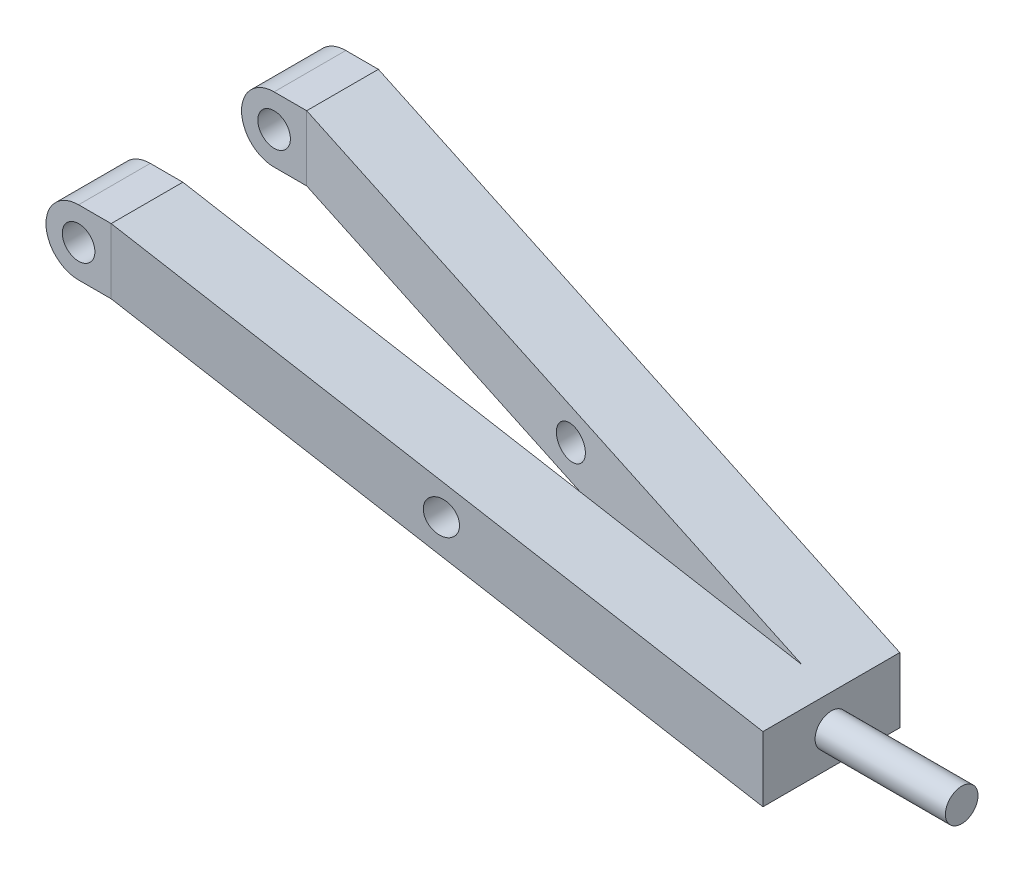
ISO-10303-21;
HEADER;
FILE_DESCRIPTION(('STEP AP214'),'2;1');
FILE_NAME('part.step','',(''),(''),'','','');
FILE_SCHEMA(('AUTOMOTIVE_DESIGN { 1 0 10303 214 1 1 1 1 }'));
ENDSEC;
DATA;
#1=APPLICATION_CONTEXT('core data for automotive mechanical design processes');
#2=APPLICATION_PROTOCOL_DEFINITION('international standard','automotive_design',2000,#1);
#3=PRODUCT_CONTEXT('',#1,'mechanical');
#4=PRODUCT('Part','Part','',(#3));
#5=PRODUCT_RELATED_PRODUCT_CATEGORY('part','',(#4));
#6=PRODUCT_DEFINITION_FORMATION('','',#4);
#7=PRODUCT_DEFINITION_CONTEXT('part definition',#1,'design');
#8=PRODUCT_DEFINITION('design','',#6,#7);
#9=PRODUCT_DEFINITION_SHAPE('','',#8);
#10=(LENGTH_UNIT() NAMED_UNIT(*) SI_UNIT(.MILLI.,.METRE.));
#11=(NAMED_UNIT(*) PLANE_ANGLE_UNIT() SI_UNIT($,.RADIAN.));
#12=(NAMED_UNIT(*) SI_UNIT($,.STERADIAN.) SOLID_ANGLE_UNIT());
#13=UNCERTAINTY_MEASURE_WITH_UNIT(LENGTH_MEASURE(1.E-05),#10,'distance_accuracy_value','');
#14=(GEOMETRIC_REPRESENTATION_CONTEXT(3) GLOBAL_UNCERTAINTY_ASSIGNED_CONTEXT((#13)) GLOBAL_UNIT_ASSIGNED_CONTEXT((#10,
#11,#12)) REPRESENTATION_CONTEXT('',''));
#15=CARTESIAN_POINT('',(0.,0.,0.));
#16=DIRECTION('',(0.,0.,1.));
#17=DIRECTION('',(1.,0.,0.));
#18=AXIS2_PLACEMENT_3D('',#15,#16,#17);
#19=CARTESIAN_POINT('',(241.3,-82.55,-1.27));
#20=DIRECTION('',(1.,0.,0.));
#21=DIRECTION('',(0.,0.,-1.));
#22=AXIS2_PLACEMENT_3D('',#19,#20,#21);
#23=PLANE('',#22);
#24=DIRECTION('',(0.,0.,-1.));
#25=VECTOR('',#24,1.);
#26=CARTESIAN_POINT('',(241.3,-82.55,26.67));
#27=LINE('',#26,#25);
#28=CARTESIAN_POINT('',(241.3,-82.55,26.67));
#29=VERTEX_POINT('',#28);
#30=CARTESIAN_POINT('',(241.3,-82.55,-26.67));
#31=VERTEX_POINT('',#30);
#32=EDGE_CURVE('E150',#29,#31,#27,.T.);
#33=ORIENTED_EDGE('',*,*,#32,.T.);
#34=DIRECTION('',(0.,-1.,0.));
#35=VECTOR('',#34,1.);
#36=CARTESIAN_POINT('',(241.3,-57.15,-26.67));
#37=LINE('',#36,#35);
#38=CARTESIAN_POINT('',(241.3,-57.15,-26.67));
#39=VERTEX_POINT('',#38);
#40=EDGE_CURVE('E195',#39,#31,#37,.T.);
#41=ORIENTED_EDGE('',*,*,#40,.F.);
#42=DIRECTION('',(0.,0.,1.));
#43=VECTOR('',#42,1.);
#44=CARTESIAN_POINT('',(241.3,-57.15,26.67));
#45=LINE('',#44,#43);
#46=CARTESIAN_POINT('',(241.3,-57.15,26.67));
#47=VERTEX_POINT('',#46);
#48=EDGE_CURVE('E147',#39,#47,#45,.T.);
#49=ORIENTED_EDGE('',*,*,#48,.T.);
#50=DIRECTION('',(0.,-1.,0.));
#51=VECTOR('',#50,1.);
#52=CARTESIAN_POINT('',(241.3,-57.15,26.67));
#53=LINE('',#52,#51);
#54=EDGE_CURVE('E49',#47,#29,#53,.T.);
#55=ORIENTED_EDGE('',*,*,#54,.T.);
#56=EDGE_LOOP('',(#33,#41,#49,#55));
#57=FACE_BOUND('',#56,.T.);
#58=CARTESIAN_POINT('',(241.3,-69.85,0.));
#59=DIRECTION('',(1.,0.,0.));
#60=DIRECTION('',(0.,0.,-1.));
#61=AXIS2_PLACEMENT_3D('',#58,#59,#60);
#62=CIRCLE('',#61,6.34999999999999);
#63=CARTESIAN_POINT('',(241.3,-69.85,-6.34999999999999));
#64=VERTEX_POINT('',#63);
#65=EDGE_CURVE('E299',#64,#64,#62,.T.);
#66=ORIENTED_EDGE('',*,*,#65,.F.);
#67=EDGE_LOOP('',(#66));
#68=FACE_BOUND('',#67,.T.);
#69=ADVANCED_FACE('F31',(#57,#68),#23,.T.);
#70=CARTESIAN_POINT('',(-12.7,12.7,52.07));
#71=DIRECTION('',(0.,0.,1.));
#72=DIRECTION('',(1.,0.,0.));
#73=AXIS2_PLACEMENT_3D('',#70,#71,#72);
#74=PLANE('',#73);
#75=CARTESIAN_POINT('',(0.,0.,52.07));
#76=DIRECTION('',(0.,0.,-1.));
#77=DIRECTION('',(-1.,0.,0.));
#78=AXIS2_PLACEMENT_3D('',#75,#76,#77);
#79=CIRCLE('',#78,6.35);
#80=CARTESIAN_POINT('',(-6.35,0.,52.07));
#81=VERTEX_POINT('',#80);
#82=EDGE_CURVE('E171',#81,#81,#79,.T.);
#83=ORIENTED_EDGE('',*,*,#82,.T.);
#84=EDGE_LOOP('',(#83));
#85=FACE_BOUND('',#84,.T.);
#86=CARTESIAN_POINT('',(0.,0.,52.07));
#87=DIRECTION('',(0.,0.,1.));
#88=DIRECTION('',(-1.,0.,0.));
#89=AXIS2_PLACEMENT_3D('',#86,#87,#88);
#90=CIRCLE('',#89,12.7);
#91=CARTESIAN_POINT('',(0.,12.7,52.07));
#92=VERTEX_POINT('',#91);
#93=CARTESIAN_POINT('',(0.,-12.7,52.07));
#94=VERTEX_POINT('',#93);
#95=EDGE_CURVE('E110',#92,#94,#90,.T.);
#96=ORIENTED_EDGE('',*,*,#95,.T.);
#97=DIRECTION('',(1.,0.,0.));
#98=VECTOR('',#97,1.);
#99=CARTESIAN_POINT('',(-12.7,-12.7,52.07));
#100=LINE('',#99,#98);
#101=CARTESIAN_POINT('',(12.7,-12.7,52.07));
#102=VERTEX_POINT('',#101);
#103=EDGE_CURVE('E115',#94,#102,#100,.T.);
#104=ORIENTED_EDGE('',*,*,#103,.T.);
#105=DIRECTION('',(0.,-1.,0.));
#106=VECTOR('',#105,1.);
#107=CARTESIAN_POINT('',(12.7,12.7,52.07));
#108=LINE('',#107,#106);
#109=CARTESIAN_POINT('',(12.7,12.7,52.07));
#110=VERTEX_POINT('',#109);
#111=EDGE_CURVE('E159',#110,#102,#108,.T.);
#112=ORIENTED_EDGE('',*,*,#111,.F.);
#113=DIRECTION('',(1.,0.,0.));
#114=VECTOR('',#113,1.);
#115=CARTESIAN_POINT('',(-12.7,12.7,52.07));
#116=LINE('',#115,#114);
#117=EDGE_CURVE('E118',#92,#110,#116,.T.);
#118=ORIENTED_EDGE('',*,*,#117,.F.);
#119=EDGE_LOOP('',(#96,#104,#112,#118));
#120=FACE_BOUND('',#119,.T.);
#121=ADVANCED_FACE('F112',(#85,#120),#74,.T.);
#122=CARTESIAN_POINT('',(-12.7,-12.7,24.13));
#123=DIRECTION('',(0.,0.,-1.));
#124=DIRECTION('',(0.,1.,0.));
#125=AXIS2_PLACEMENT_3D('',#122,#123,#124);
#126=PLANE('',#125);
#127=CARTESIAN_POINT('',(0.,0.,24.13));
#128=DIRECTION('',(0.,0.,-1.));
#129=DIRECTION('',(0.,1.,0.));
#130=AXIS2_PLACEMENT_3D('',#127,#128,#129);
#131=CIRCLE('',#130,6.35);
#132=CARTESIAN_POINT('',(0.,6.35,24.13));
#133=VERTEX_POINT('',#132);
#134=EDGE_CURVE('E170',#133,#133,#131,.T.);
#135=ORIENTED_EDGE('',*,*,#134,.F.);
#136=EDGE_LOOP('',(#135));
#137=FACE_BOUND('',#136,.T.);
#138=DIRECTION('',(1.,0.,0.));
#139=VECTOR('',#138,1.);
#140=CARTESIAN_POINT('',(-12.7,-12.7,24.13));
#141=LINE('',#140,#139);
#142=CARTESIAN_POINT('',(0.,-12.7,24.13));
#143=VERTEX_POINT('',#142);
#144=CARTESIAN_POINT('',(12.7,-12.7,24.13));
#145=VERTEX_POINT('',#144);
#146=EDGE_CURVE('E137',#143,#145,#141,.T.);
#147=ORIENTED_EDGE('',*,*,#146,.F.);
#148=CARTESIAN_POINT('',(0.,0.,24.13));
#149=DIRECTION('',(0.,0.,-1.));
#150=DIRECTION('',(0.,1.,0.));
#151=AXIS2_PLACEMENT_3D('',#148,#149,#150);
#152=CIRCLE('',#151,12.7);
#153=CARTESIAN_POINT('',(0.,12.7,24.13));
#154=VERTEX_POINT('',#153);
#155=EDGE_CURVE('E128',#154,#143,#152,.F.);
#156=ORIENTED_EDGE('',*,*,#155,.F.);
#157=DIRECTION('',(1.,0.,0.));
#158=VECTOR('',#157,1.);
#159=CARTESIAN_POINT('',(-12.7,12.7,24.13));
#160=LINE('',#159,#158);
#161=CARTESIAN_POINT('',(12.7,12.7,24.13));
#162=VERTEX_POINT('',#161);
#163=EDGE_CURVE('E140',#154,#162,#160,.T.);
#164=ORIENTED_EDGE('',*,*,#163,.T.);
#165=DIRECTION('',(0.,1.,0.));
#166=VECTOR('',#165,1.);
#167=CARTESIAN_POINT('',(12.7,12.7,24.13));
#168=LINE('',#167,#166);
#169=EDGE_CURVE('E153',#145,#162,#168,.T.);
#170=ORIENTED_EDGE('',*,*,#169,.F.);
#171=EDGE_LOOP('',(#147,#156,#164,#170));
#172=FACE_BOUND('',#171,.T.);
#173=ADVANCED_FACE('F223',(#137,#172),#126,.T.);
#174=CARTESIAN_POINT('',(-12.7,-12.7,52.07));
#175=DIRECTION('',(0.,-1.,0.));
#176=DIRECTION('',(0.,0.,-1.));
#177=AXIS2_PLACEMENT_3D('',#174,#175,#176);
#178=PLANE('',#177);
#179=ORIENTED_EDGE('',*,*,#103,.F.);
#180=DIRECTION('',(0.,0.,-1.));
#181=VECTOR('',#180,1.);
#182=CARTESIAN_POINT('',(0.,-12.7,52.07));
#183=LINE('',#182,#181);
#184=EDGE_CURVE('E125',#94,#143,#183,.T.);
#185=ORIENTED_EDGE('',*,*,#184,.T.);
#186=ORIENTED_EDGE('',*,*,#146,.T.);
#187=DIRECTION('',(0.,0.,-1.));
#188=VECTOR('',#187,1.);
#189=CARTESIAN_POINT('',(12.7,-12.7,52.07));
#190=LINE('',#189,#188);
#191=EDGE_CURVE('E135',#102,#145,#190,.T.);
#192=ORIENTED_EDGE('',*,*,#191,.F.);
#193=EDGE_LOOP('',(#179,#185,#186,#192));
#194=FACE_BOUND('',#193,.T.);
#195=ADVANCED_FACE('F133',(#194),#178,.T.);
#196=CARTESIAN_POINT('',(-12.7,12.7,-52.07));
#197=DIRECTION('',(0.,0.,1.));
#198=DIRECTION('',(1.,0.,0.));
#199=AXIS2_PLACEMENT_3D('',#196,#197,#198);
#200=PLANE('',#199);
#201=CARTESIAN_POINT('',(0.,0.,-52.07));
#202=DIRECTION('',(0.,0.,-1.));
#203=DIRECTION('',(-1.,0.,0.));
#204=AXIS2_PLACEMENT_3D('',#201,#202,#203);
#205=CIRCLE('',#204,6.35);
#206=CARTESIAN_POINT('',(-6.35,0.,-52.07));
#207=VERTEX_POINT('',#206);
#208=EDGE_CURVE('E178',#207,#207,#205,.T.);
#209=ORIENTED_EDGE('',*,*,#208,.F.);
#210=EDGE_LOOP('',(#209));
#211=FACE_BOUND('',#210,.T.);
#212=DIRECTION('',(1.,0.,0.));
#213=VECTOR('',#212,1.);
#214=CARTESIAN_POINT('',(-12.7,-12.7,-52.07));
#215=LINE('',#214,#213);
#216=CARTESIAN_POINT('',(0.,-12.7,-52.07));
#217=VERTEX_POINT('',#216);
#218=CARTESIAN_POINT('',(12.7,-12.7,-52.07));
#219=VERTEX_POINT('',#218);
#220=EDGE_CURVE('E187',#217,#219,#215,.T.);
#221=ORIENTED_EDGE('',*,*,#220,.F.);
#222=CARTESIAN_POINT('',(0.,0.,-52.07));
#223=DIRECTION('',(0.,0.,1.));
#224=DIRECTION('',(-1.,0.,0.));
#225=AXIS2_PLACEMENT_3D('',#222,#223,#224);
#226=CIRCLE('',#225,12.7);
#227=CARTESIAN_POINT('',(0.,12.7,-52.07));
#228=VERTEX_POINT('',#227);
#229=EDGE_CURVE('E122',#228,#217,#226,.T.);
#230=ORIENTED_EDGE('',*,*,#229,.F.);
#231=DIRECTION('',(1.,0.,0.));
#232=VECTOR('',#231,1.);
#233=CARTESIAN_POINT('',(-12.7,12.7,-52.07));
#234=LINE('',#233,#232);
#235=CARTESIAN_POINT('',(12.7,12.7,-52.07));
#236=VERTEX_POINT('',#235);
#237=EDGE_CURVE('E175',#228,#236,#234,.T.);
#238=ORIENTED_EDGE('',*,*,#237,.T.);
#239=DIRECTION('',(0.,-1.,0.));
#240=VECTOR('',#239,1.);
#241=CARTESIAN_POINT('',(12.7,12.7,-52.07));
#242=LINE('',#241,#240);
#243=EDGE_CURVE('E205',#236,#219,#242,.T.);
#244=ORIENTED_EDGE('',*,*,#243,.T.);
#245=EDGE_LOOP('',(#221,#230,#238,#244));
#246=FACE_BOUND('',#245,.T.);
#247=ADVANCED_FACE('F253',(#211,#246),#200,.F.);
#248=CARTESIAN_POINT('',(-12.7,-12.7,-24.13));
#249=DIRECTION('',(0.,0.,-1.));
#250=DIRECTION('',(0.,1.,0.));
#251=AXIS2_PLACEMENT_3D('',#248,#249,#250);
#252=PLANE('',#251);
#253=CARTESIAN_POINT('',(0.,0.,-24.13));
#254=DIRECTION('',(0.,0.,-1.));
#255=DIRECTION('',(0.,1.,0.));
#256=AXIS2_PLACEMENT_3D('',#253,#254,#255);
#257=CIRCLE('',#256,6.35);
#258=CARTESIAN_POINT('',(0.,6.35,-24.13));
#259=VERTEX_POINT('',#258);
#260=EDGE_CURVE('E168',#259,#259,#257,.T.);
#261=ORIENTED_EDGE('',*,*,#260,.T.);
#262=EDGE_LOOP('',(#261));
#263=FACE_BOUND('',#262,.T.);
#264=CARTESIAN_POINT('',(0.,0.,-24.13));
#265=DIRECTION('',(0.,0.,-1.));
#266=DIRECTION('',(0.,1.,0.));
#267=AXIS2_PLACEMENT_3D('',#264,#265,#266);
#268=CIRCLE('',#267,12.7);
#269=CARTESIAN_POINT('',(0.,12.7,-24.13));
#270=VERTEX_POINT('',#269);
#271=CARTESIAN_POINT('',(0.,-12.7,-24.13));
#272=VERTEX_POINT('',#271);
#273=EDGE_CURVE('E314',#270,#272,#268,.F.);
#274=ORIENTED_EDGE('',*,*,#273,.T.);
#275=DIRECTION('',(1.,0.,0.));
#276=VECTOR('',#275,1.);
#277=CARTESIAN_POINT('',(-12.7,-12.7,-24.13));
#278=LINE('',#277,#276);
#279=CARTESIAN_POINT('',(12.7,-12.7,-24.13));
#280=VERTEX_POINT('',#279);
#281=EDGE_CURVE('E190',#272,#280,#278,.T.);
#282=ORIENTED_EDGE('',*,*,#281,.T.);
#283=DIRECTION('',(0.,1.,0.));
#284=VECTOR('',#283,1.);
#285=CARTESIAN_POINT('',(12.7,12.7,-24.13));
#286=LINE('',#285,#284);
#287=CARTESIAN_POINT('',(12.7,12.7,-24.13));
#288=VERTEX_POINT('',#287);
#289=EDGE_CURVE('E189',#280,#288,#286,.T.);
#290=ORIENTED_EDGE('',*,*,#289,.T.);
#291=DIRECTION('',(1.,0.,0.));
#292=VECTOR('',#291,1.);
#293=CARTESIAN_POINT('',(-12.7,12.7,-24.13));
#294=LINE('',#293,#292);
#295=EDGE_CURVE('E192',#270,#288,#294,.T.);
#296=ORIENTED_EDGE('',*,*,#295,.F.);
#297=EDGE_LOOP('',(#274,#282,#290,#296));
#298=FACE_BOUND('',#297,.T.);
#299=ADVANCED_FACE('F261',(#263,#298),#252,.F.);
#300=CARTESIAN_POINT('',(-12.7,12.7,24.13));
#301=DIRECTION('',(0.,1.,0.));
#302=DIRECTION('',(0.,0.,1.));
#303=AXIS2_PLACEMENT_3D('',#300,#301,#302);
#304=PLANE('',#303);
#305=ORIENTED_EDGE('',*,*,#163,.F.);
#306=DIRECTION('',(0.,0.,-1.));
#307=VECTOR('',#306,1.);
#308=CARTESIAN_POINT('',(0.,12.7,52.07));
#309=LINE('',#308,#307);
#310=EDGE_CURVE('E313',#92,#154,#309,.T.);
#311=ORIENTED_EDGE('',*,*,#310,.F.);
#312=ORIENTED_EDGE('',*,*,#117,.T.);
#313=DIRECTION('',(0.,0.,1.));
#314=VECTOR('',#313,1.);
#315=CARTESIAN_POINT('',(12.7,12.7,52.07));
#316=LINE('',#315,#314);
#317=EDGE_CURVE('E156',#162,#110,#316,.T.);
#318=ORIENTED_EDGE('',*,*,#317,.F.);
#319=EDGE_LOOP('',(#305,#311,#312,#318));
#320=FACE_BOUND('',#319,.T.);
#321=ADVANCED_FACE('F233',(#320),#304,.T.);
#322=CARTESIAN_POINT('',(241.3,-57.15,-1.27));
#323=DIRECTION('',(0.110431526074846,0.,0.993883734673619));
#324=DIRECTION('',(0.993883734673619,0.,-0.110431526074846));
#325=AXIS2_PLACEMENT_3D('',#322,#323,#324);
#326=PLANE('',#325);
#327=CARTESIAN_POINT('',(128.524,-34.925,11.2606666666667));
#328=DIRECTION('',(0.110431526074846,0.,0.993883734673619));
#329=DIRECTION('',(-0.993883734673619,0.,0.110431526074846));
#330=AXIS2_PLACEMENT_3D('',#327,#328,#329);
#331=ELLIPSE('',#330,6.38907729190806,6.35);
#332=CARTESIAN_POINT('',(122.174,-34.925,11.9662222222222));
#333=VERTEX_POINT('',#332);
#334=EDGE_CURVE('E297',#333,#333,#331,.T.);
#335=ORIENTED_EDGE('',*,*,#334,.T.);
#336=EDGE_LOOP('',(#335));
#337=FACE_BOUND('',#336,.T.);
#338=DIRECTION('',(-0.950997566373925,0.290582589725366,0.105666396263769));
#339=VECTOR('',#338,1.);
#340=CARTESIAN_POINT('',(241.3,-57.15,-1.27));
#341=LINE('',#340,#339);
#342=CARTESIAN_POINT('',(229.87,-53.6575,0.));
#343=VERTEX_POINT('',#342);
#344=EDGE_CURVE('E11',#343,#162,#341,.T.);
#345=ORIENTED_EDGE('',*,*,#344,.F.);
#346=DIRECTION('',(0.,-1.,0.));
#347=VECTOR('',#346,1.);
#348=CARTESIAN_POINT('',(229.87,-57.15,0.));
#349=LINE('',#348,#347);
#350=CARTESIAN_POINT('',(229.87,-79.0575,0.));
#351=VERTEX_POINT('',#350);
#352=EDGE_CURVE('E138',#343,#351,#349,.T.);
#353=ORIENTED_EDGE('',*,*,#352,.T.);
#354=DIRECTION('',(-0.950997566373925,0.290582589725366,0.105666396263769));
#355=VECTOR('',#354,1.);
#356=CARTESIAN_POINT('',(241.3,-82.55,-1.27));
#357=LINE('',#356,#355);
#358=EDGE_CURVE('E152',#351,#145,#357,.T.);
#359=ORIENTED_EDGE('',*,*,#358,.T.);
#360=ORIENTED_EDGE('',*,*,#169,.T.);
#361=EDGE_LOOP('',(#345,#353,#359,#360));
#362=FACE_BOUND('',#361,.T.);
#363=ADVANCED_FACE('F33',(#337,#362),#326,.F.);
#364=CARTESIAN_POINT('',(241.3,-57.15,26.67));
#365=DIRECTION('',(-0.29221853559902,-0.956351571051339,0.));
#366=DIRECTION('',(0.956351571051339,-0.29221853559902,0.));
#367=AXIS2_PLACEMENT_3D('',#364,#365,#366);
#368=PLANE('',#367);
#369=DIRECTION('',(-0.950997566373925,0.290582589725366,0.105666396263769));
#370=VECTOR('',#369,1.);
#371=CARTESIAN_POINT('',(241.3,-57.15,26.67));
#372=LINE('',#371,#370);
#373=EDGE_CURVE('E41',#47,#110,#372,.T.);
#374=ORIENTED_EDGE('',*,*,#373,.F.);
#375=ORIENTED_EDGE('',*,*,#48,.F.);
#376=DIRECTION('',(-0.950997566373925,0.290582589725366,-0.105666396263769));
#377=VECTOR('',#376,1.);
#378=CARTESIAN_POINT('',(241.3,-57.15,-26.67));
#379=LINE('',#378,#377);
#380=EDGE_CURVE('E212',#39,#236,#379,.T.);
#381=ORIENTED_EDGE('',*,*,#380,.T.);
#382=DIRECTION('',(0.,0.,-1.));
#383=VECTOR('',#382,1.);
#384=CARTESIAN_POINT('',(12.7,12.7,-52.07));
#385=LINE('',#384,#383);
#386=EDGE_CURVE('E199',#288,#236,#385,.T.);
#387=ORIENTED_EDGE('',*,*,#386,.F.);
#388=DIRECTION('',(-0.950997566373925,0.290582589725366,-0.105666396263769));
#389=VECTOR('',#388,1.);
#390=CARTESIAN_POINT('',(241.3,-57.15,1.27));
#391=LINE('',#390,#389);
#392=EDGE_CURVE('E198',#343,#288,#391,.T.);
#393=ORIENTED_EDGE('',*,*,#392,.F.);
#394=ORIENTED_EDGE('',*,*,#344,.T.);
#395=ORIENTED_EDGE('',*,*,#317,.T.);
#396=EDGE_LOOP('',(#374,#375,#381,#387,#393,#394,#395));
#397=FACE_BOUND('',#396,.T.);
#398=ADVANCED_FACE('F230',(#397),#368,.F.);
#399=CARTESIAN_POINT('',(241.3,-57.15,26.67));
#400=DIRECTION('',(-0.110431526074847,0.,-0.993883734673619));
#401=DIRECTION('',(-0.993883734673619,0.,0.110431526074847));
#402=AXIS2_PLACEMENT_3D('',#399,#400,#401);
#403=PLANE('',#402);
#404=CARTESIAN_POINT('',(128.524,-34.925,39.2006666666667));
#405=DIRECTION('',(-0.110431526074847,0.,-0.993883734673619));
#406=DIRECTION('',(-0.993883734673619,0.,0.110431526074847));
#407=AXIS2_PLACEMENT_3D('',#404,#405,#406);
#408=ELLIPSE('',#407,6.38907729190806,6.35);
#409=CARTESIAN_POINT('',(122.174,-34.925,39.9062222222222));
#410=VERTEX_POINT('',#409);
#411=EDGE_CURVE('E300',#410,#410,#408,.T.);
#412=ORIENTED_EDGE('',*,*,#411,.T.);
#413=EDGE_LOOP('',(#412));
#414=FACE_BOUND('',#413,.T.);
#415=ORIENTED_EDGE('',*,*,#111,.T.);
#416=DIRECTION('',(-0.950997566373925,0.290582589725366,0.105666396263769));
#417=VECTOR('',#416,1.);
#418=CARTESIAN_POINT('',(241.3,-82.55,26.67));
#419=LINE('',#418,#417);
#420=EDGE_CURVE('E164',#29,#102,#419,.T.);
#421=ORIENTED_EDGE('',*,*,#420,.F.);
#422=ORIENTED_EDGE('',*,*,#54,.F.);
#423=ORIENTED_EDGE('',*,*,#373,.T.);
#424=EDGE_LOOP('',(#415,#421,#422,#423));
#425=FACE_BOUND('',#424,.T.);
#426=ADVANCED_FACE('F242',(#414,#425),#403,.F.);
#427=CARTESIAN_POINT('',(241.3,-82.55,26.67));
#428=DIRECTION('',(0.29221853559902,0.956351571051339,0.));
#429=DIRECTION('',(-0.956351571051339,0.29221853559902,0.));
#430=AXIS2_PLACEMENT_3D('',#427,#428,#429);
#431=PLANE('',#430);
#432=ORIENTED_EDGE('',*,*,#358,.F.);
#433=DIRECTION('',(-0.950997566373925,0.290582589725366,-0.105666396263769));
#434=VECTOR('',#433,1.);
#435=CARTESIAN_POINT('',(241.3,-82.55,1.27));
#436=LINE('',#435,#434);
#437=EDGE_CURVE('E143',#351,#280,#436,.T.);
#438=ORIENTED_EDGE('',*,*,#437,.T.);
#439=DIRECTION('',(0.,0.,1.));
#440=VECTOR('',#439,1.);
#441=CARTESIAN_POINT('',(12.7,-12.7,-52.07));
#442=LINE('',#441,#440);
#443=EDGE_CURVE('E202',#219,#280,#442,.T.);
#444=ORIENTED_EDGE('',*,*,#443,.F.);
#445=DIRECTION('',(-0.950997566373925,0.290582589725366,-0.105666396263769));
#446=VECTOR('',#445,1.);
#447=CARTESIAN_POINT('',(241.3,-82.55,-26.67));
#448=LINE('',#447,#446);
#449=EDGE_CURVE('E215',#31,#219,#448,.T.);
#450=ORIENTED_EDGE('',*,*,#449,.F.);
#451=ORIENTED_EDGE('',*,*,#32,.F.);
#452=ORIENTED_EDGE('',*,*,#420,.T.);
#453=ORIENTED_EDGE('',*,*,#191,.T.);
#454=EDGE_LOOP('',(#432,#438,#444,#450,#451,#452,#453));
#455=FACE_BOUND('',#454,.T.);
#456=ADVANCED_FACE('F236',(#455),#431,.F.);
#457=CARTESIAN_POINT('',(241.3,-57.15,1.27));
#458=DIRECTION('',(-0.110431526074846,0.,0.993883734673619));
#459=DIRECTION('',(0.993883734673619,0.,0.110431526074846));
#460=AXIS2_PLACEMENT_3D('',#457,#458,#459);
#461=PLANE('',#460);
#462=CARTESIAN_POINT('',(128.524,-34.925,-11.2606666666667));
#463=DIRECTION('',(-0.110431526074846,0.,0.993883734673619));
#464=DIRECTION('',(0.993883734673619,0.,0.110431526074846));
#465=AXIS2_PLACEMENT_3D('',#462,#463,#464);
#466=ELLIPSE('',#465,6.38907729190806,6.35);
#467=CARTESIAN_POINT('',(134.874,-34.925,-10.5551111111111));
#468=VERTEX_POINT('',#467);
#469=EDGE_CURVE('E306',#468,#468,#466,.T.);
#470=ORIENTED_EDGE('',*,*,#469,.F.);
#471=EDGE_LOOP('',(#470));
#472=FACE_BOUND('',#471,.T.);
#473=ORIENTED_EDGE('',*,*,#352,.F.);
#474=ORIENTED_EDGE('',*,*,#392,.T.);
#475=ORIENTED_EDGE('',*,*,#289,.F.);
#476=ORIENTED_EDGE('',*,*,#437,.F.);
#477=EDGE_LOOP('',(#473,#474,#475,#476));
#478=FACE_BOUND('',#477,.T.);
#479=ADVANCED_FACE('F263',(#472,#478),#461,.T.);
#480=CARTESIAN_POINT('',(241.3,-57.15,-26.67));
#481=DIRECTION('',(0.110431526074847,0.,-0.993883734673619));
#482=DIRECTION('',(-0.993883734673619,0.,-0.110431526074847));
#483=AXIS2_PLACEMENT_3D('',#480,#481,#482);
#484=PLANE('',#483);
#485=CARTESIAN_POINT('',(128.524,-34.925,-39.2006666666667));
#486=DIRECTION('',(0.110431526074847,0.,-0.993883734673619));
#487=DIRECTION('',(0.993883734673619,0.,0.110431526074847));
#488=AXIS2_PLACEMENT_3D('',#485,#486,#487);
#489=ELLIPSE('',#488,6.38907729190806,6.35);
#490=CARTESIAN_POINT('',(134.874,-34.925,-38.4951111111111));
#491=VERTEX_POINT('',#490);
#492=EDGE_CURVE('E35',#491,#491,#489,.T.);
#493=ORIENTED_EDGE('',*,*,#492,.F.);
#494=EDGE_LOOP('',(#493));
#495=FACE_BOUND('',#494,.T.);
#496=ORIENTED_EDGE('',*,*,#243,.F.);
#497=ORIENTED_EDGE('',*,*,#380,.F.);
#498=ORIENTED_EDGE('',*,*,#40,.T.);
#499=ORIENTED_EDGE('',*,*,#449,.T.);
#500=EDGE_LOOP('',(#496,#497,#498,#499));
#501=FACE_BOUND('',#500,.T.);
#502=ADVANCED_FACE('F247',(#495,#501),#484,.T.);
#503=CARTESIAN_POINT('',(-12.7,-12.7,-52.07));
#504=DIRECTION('',(0.,1.,0.));
#505=DIRECTION('',(0.,0.,1.));
#506=AXIS2_PLACEMENT_3D('',#503,#504,#505);
#507=PLANE('',#506);
#508=ORIENTED_EDGE('',*,*,#281,.F.);
#509=EDGE_CURVE('E131',#272,#217,#183,.T.);
#510=ORIENTED_EDGE('',*,*,#509,.T.);
#511=ORIENTED_EDGE('',*,*,#220,.T.);
#512=ORIENTED_EDGE('',*,*,#443,.T.);
#513=EDGE_LOOP('',(#508,#510,#511,#512));
#514=FACE_BOUND('',#513,.T.);
#515=ADVANCED_FACE('F271',(#514),#507,.F.);
#516=CARTESIAN_POINT('',(-12.7,12.7,-24.13));
#517=DIRECTION('',(0.,-1.,0.));
#518=DIRECTION('',(0.,0.,-1.));
#519=AXIS2_PLACEMENT_3D('',#516,#517,#518);
#520=PLANE('',#519);
#521=ORIENTED_EDGE('',*,*,#237,.F.);
#522=EDGE_CURVE('E121',#270,#228,#309,.T.);
#523=ORIENTED_EDGE('',*,*,#522,.F.);
#524=ORIENTED_EDGE('',*,*,#295,.T.);
#525=ORIENTED_EDGE('',*,*,#386,.T.);
#526=EDGE_LOOP('',(#521,#523,#524,#525));
#527=FACE_BOUND('',#526,.T.);
#528=ADVANCED_FACE('F258',(#527),#520,.F.);
#529=CARTESIAN_POINT('',(0.,0.,52.07));
#530=DIRECTION('',(0.,0.,-1.));
#531=DIRECTION('',(-1.,0.,0.));
#532=AXIS2_PLACEMENT_3D('',#529,#530,#531);
#533=CYLINDRICAL_SURFACE('',#532,6.35);
#534=ORIENTED_EDGE('',*,*,#208,.T.);
#535=EDGE_LOOP('',(#534));
#536=FACE_BOUND('',#535,.T.);
#537=ORIENTED_EDGE('',*,*,#260,.F.);
#538=EDGE_LOOP('',(#537));
#539=FACE_BOUND('',#538,.T.);
#540=ADVANCED_FACE('F324',(#536,#539),#533,.F.);
#541=ORIENTED_EDGE('',*,*,#134,.T.);
#542=EDGE_LOOP('',(#541));
#543=FACE_BOUND('',#542,.T.);
#544=ORIENTED_EDGE('',*,*,#82,.F.);
#545=EDGE_LOOP('',(#544));
#546=FACE_BOUND('',#545,.T.);
#547=ADVANCED_FACE('F328',(#543,#546),#533,.F.);
#548=CARTESIAN_POINT('',(0.,0.,52.07));
#549=DIRECTION('',(0.,0.,-1.));
#550=DIRECTION('',(-1.,0.,0.));
#551=AXIS2_PLACEMENT_3D('',#548,#549,#550);
#552=CYLINDRICAL_SURFACE('',#551,12.7);
#553=ORIENTED_EDGE('',*,*,#522,.T.);
#554=ORIENTED_EDGE('',*,*,#229,.T.);
#555=ORIENTED_EDGE('',*,*,#509,.F.);
#556=ORIENTED_EDGE('',*,*,#273,.F.);
#557=EDGE_LOOP('',(#553,#554,#555,#556));
#558=FACE_BOUND('',#557,.T.);
#559=ADVANCED_FACE('F318',(#558),#552,.T.);
#560=ORIENTED_EDGE('',*,*,#155,.T.);
#561=ORIENTED_EDGE('',*,*,#184,.F.);
#562=ORIENTED_EDGE('',*,*,#95,.F.);
#563=ORIENTED_EDGE('',*,*,#310,.T.);
#564=EDGE_LOOP('',(#560,#561,#562,#563));
#565=FACE_BOUND('',#564,.T.);
#566=ADVANCED_FACE('F126',(#565),#552,.T.);
#567=CARTESIAN_POINT('',(292.1,-69.85,0.));
#568=DIRECTION('',(-1.,0.,0.));
#569=DIRECTION('',(0.,0.,1.));
#570=AXIS2_PLACEMENT_3D('',#567,#568,#569);
#571=CYLINDRICAL_SURFACE('',#570,6.34999999999999);
#572=CARTESIAN_POINT('',(292.1,-69.85,0.));
#573=DIRECTION('',(1.,0.,0.));
#574=DIRECTION('',(0.,0.,-1.));
#575=AXIS2_PLACEMENT_3D('',#572,#573,#574);
#576=CIRCLE('',#575,6.34999999999999);
#577=CARTESIAN_POINT('',(292.1,-69.85,-6.34999999999999));
#578=VERTEX_POINT('',#577);
#579=EDGE_CURVE('E303',#578,#578,#576,.T.);
#580=ORIENTED_EDGE('',*,*,#579,.F.);
#581=EDGE_LOOP('',(#580));
#582=FACE_BOUND('',#581,.T.);
#583=ORIENTED_EDGE('',*,*,#65,.T.);
#584=EDGE_LOOP('',(#583));
#585=FACE_BOUND('',#584,.T.);
#586=ADVANCED_FACE('F394',(#582,#585),#571,.T.);
#587=CARTESIAN_POINT('',(292.1,-69.85,0.));
#588=DIRECTION('',(1.,0.,0.));
#589=DIRECTION('',(0.,0.,-1.));
#590=AXIS2_PLACEMENT_3D('',#587,#588,#589);
#591=PLANE('',#590);
#592=ORIENTED_EDGE('',*,*,#579,.T.);
#593=EDGE_LOOP('',(#592));
#594=FACE_BOUND('',#593,.T.);
#595=ADVANCED_FACE('F408',(#594),#591,.T.);
#596=CARTESIAN_POINT('',(128.524,-34.925,-52.07));
#597=DIRECTION('',(0.,0.,1.));
#598=DIRECTION('',(1.,0.,0.));
#599=AXIS2_PLACEMENT_3D('',#596,#597,#598);
#600=CYLINDRICAL_SURFACE('',#599,6.35);
#601=ORIENTED_EDGE('',*,*,#469,.T.);
#602=EDGE_LOOP('',(#601));
#603=FACE_BOUND('',#602,.T.);
#604=ORIENTED_EDGE('',*,*,#492,.T.);
#605=EDGE_LOOP('',(#604));
#606=FACE_BOUND('',#605,.T.);
#607=ADVANCED_FACE('F417',(#603,#606),#600,.F.);
#608=ORIENTED_EDGE('',*,*,#411,.F.);
#609=EDGE_LOOP('',(#608));
#610=FACE_BOUND('',#609,.T.);
#611=ORIENTED_EDGE('',*,*,#334,.F.);
#612=EDGE_LOOP('',(#611));
#613=FACE_BOUND('',#612,.T.);
#614=ADVANCED_FACE('F450',(#610,#613),#600,.F.);
#615=CLOSED_SHELL('',(#69,#121,#173,#195,#247,#299,#321,#363,#398,#426,#456,#479,#502,#515,#528,
#540,#547,#559,#566,#586,#595,#607,#614));
#616=MANIFOLD_SOLID_BREP('B2',#615);
#617=ADVANCED_BREP_SHAPE_REPRESENTATION('',(#18,#616),#14);
#618=SHAPE_DEFINITION_REPRESENTATION(#9,#617);
ENDSEC;
END-ISO-10303-21;
